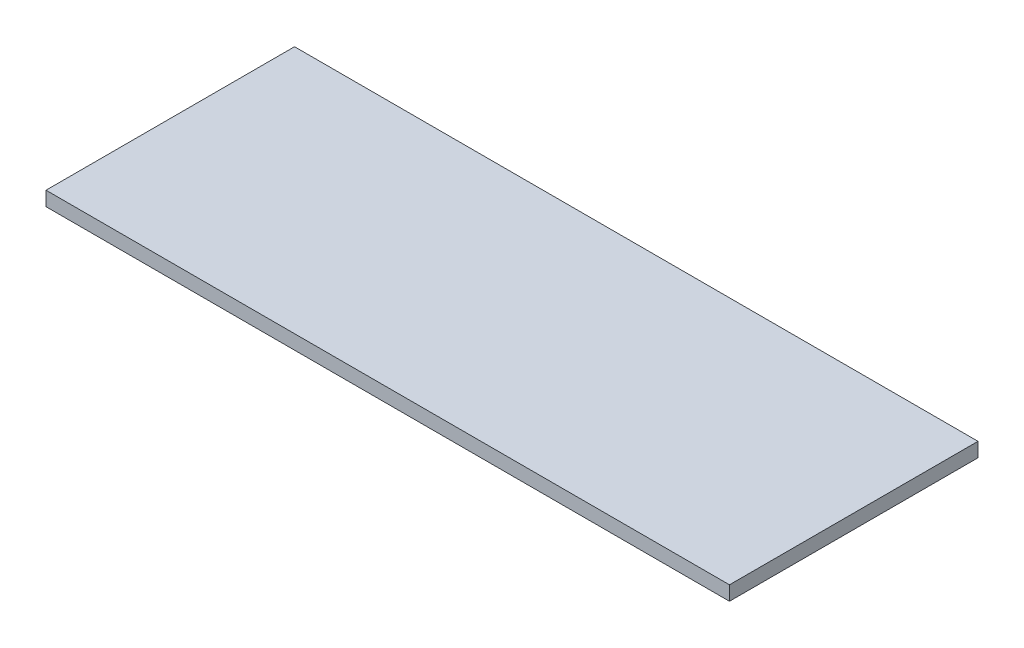
ISO-10303-21;
HEADER;
FILE_DESCRIPTION(('STEP AP214'),'2;1');
FILE_NAME('part.step','',(''),(''),'','','');
FILE_SCHEMA(('AUTOMOTIVE_DESIGN { 1 0 10303 214 1 1 1 1 }'));
ENDSEC;
DATA;
#1=APPLICATION_CONTEXT('core data for automotive mechanical design processes');
#2=APPLICATION_PROTOCOL_DEFINITION('international standard','automotive_design',2000,#1);
#3=PRODUCT_CONTEXT('',#1,'mechanical');
#4=PRODUCT('Part','Part','',(#3));
#5=PRODUCT_RELATED_PRODUCT_CATEGORY('part','',(#4));
#6=PRODUCT_DEFINITION_FORMATION('','',#4);
#7=PRODUCT_DEFINITION_CONTEXT('part definition',#1,'design');
#8=PRODUCT_DEFINITION('design','',#6,#7);
#9=PRODUCT_DEFINITION_SHAPE('','',#8);
#10=(LENGTH_UNIT() NAMED_UNIT(*) SI_UNIT(.MILLI.,.METRE.));
#11=(NAMED_UNIT(*) PLANE_ANGLE_UNIT() SI_UNIT($,.RADIAN.));
#12=(NAMED_UNIT(*) SI_UNIT($,.STERADIAN.) SOLID_ANGLE_UNIT());
#13=UNCERTAINTY_MEASURE_WITH_UNIT(LENGTH_MEASURE(1.E-05),#10,'distance_accuracy_value','');
#14=(GEOMETRIC_REPRESENTATION_CONTEXT(3) GLOBAL_UNCERTAINTY_ASSIGNED_CONTEXT((#13)) GLOBAL_UNIT_ASSIGNED_CONTEXT((#10,
#11,#12)) REPRESENTATION_CONTEXT('',''));
#15=CARTESIAN_POINT('',(0.,0.,0.));
#16=DIRECTION('',(0.,0.,1.));
#17=DIRECTION('',(1.,0.,0.));
#18=AXIS2_PLACEMENT_3D('',#15,#16,#17);
#19=CARTESIAN_POINT('',(0.,1.15,0.));
#20=DIRECTION('',(-1.,0.,0.));
#21=DIRECTION('',(0.,0.,1.));
#22=AXIS2_PLACEMENT_3D('',#19,#20,#21);
#23=PLANE('',#22);
#24=DIRECTION('',(0.,0.,-1.));
#25=VECTOR('',#24,1.);
#26=CARTESIAN_POINT('',(0.,0.,0.));
#27=LINE('',#26,#25);
#28=CARTESIAN_POINT('',(0.,0.,0.));
#29=VERTEX_POINT('',#28);
#30=CARTESIAN_POINT('',(0.,0.,-20.));
#31=VERTEX_POINT('',#30);
#32=EDGE_CURVE('E107',#29,#31,#27,.T.);
#33=ORIENTED_EDGE('',*,*,#32,.T.);
#34=DIRECTION('',(0.,-1.,0.));
#35=VECTOR('',#34,1.);
#36=CARTESIAN_POINT('',(0.,1.15,-20.));
#37=LINE('',#36,#35);
#38=CARTESIAN_POINT('',(0.,1.15,-20.));
#39=VERTEX_POINT('',#38);
#40=EDGE_CURVE('E11',#39,#31,#37,.T.);
#41=ORIENTED_EDGE('',*,*,#40,.F.);
#42=DIRECTION('',(0.,0.,-1.));
#43=VECTOR('',#42,1.);
#44=CARTESIAN_POINT('',(0.,1.15,0.));
#45=LINE('',#44,#43);
#46=CARTESIAN_POINT('',(0.,1.15,0.));
#47=VERTEX_POINT('',#46);
#48=EDGE_CURVE('E91',#47,#39,#45,.T.);
#49=ORIENTED_EDGE('',*,*,#48,.F.);
#50=DIRECTION('',(0.,-1.,0.));
#51=VECTOR('',#50,1.);
#52=CARTESIAN_POINT('',(0.,1.15,0.));
#53=LINE('',#52,#51);
#54=EDGE_CURVE('E103',#47,#29,#53,.T.);
#55=ORIENTED_EDGE('',*,*,#54,.T.);
#56=EDGE_LOOP('',(#33,#41,#49,#55));
#57=FACE_BOUND('',#56,.T.);
#58=ADVANCED_FACE('F39',(#57),#23,.F.);
#59=CARTESIAN_POINT('',(0.,1.15,-20.));
#60=DIRECTION('',(0.,0.,1.));
#61=DIRECTION('',(1.,0.,0.));
#62=AXIS2_PLACEMENT_3D('',#59,#60,#61);
#63=PLANE('',#62);
#64=DIRECTION('',(-1.,0.,0.));
#65=VECTOR('',#64,1.);
#66=CARTESIAN_POINT('',(0.,0.,-20.));
#67=LINE('',#66,#65);
#68=CARTESIAN_POINT('',(-55.,0.,-20.));
#69=VERTEX_POINT('',#68);
#70=EDGE_CURVE('E96',#31,#69,#67,.T.);
#71=ORIENTED_EDGE('',*,*,#70,.T.);
#72=DIRECTION('',(0.,-1.,0.));
#73=VECTOR('',#72,1.);
#74=CARTESIAN_POINT('',(-55.,1.15,-20.));
#75=LINE('',#74,#73);
#76=CARTESIAN_POINT('',(-55.,1.15,-20.));
#77=VERTEX_POINT('',#76);
#78=EDGE_CURVE('E48',#77,#69,#75,.T.);
#79=ORIENTED_EDGE('',*,*,#78,.F.);
#80=DIRECTION('',(-1.,0.,0.));
#81=VECTOR('',#80,1.);
#82=CARTESIAN_POINT('',(0.,1.15,-20.));
#83=LINE('',#82,#81);
#84=EDGE_CURVE('E86',#39,#77,#83,.T.);
#85=ORIENTED_EDGE('',*,*,#84,.F.);
#86=ORIENTED_EDGE('',*,*,#40,.T.);
#87=EDGE_LOOP('',(#71,#79,#85,#86));
#88=FACE_BOUND('',#87,.T.);
#89=ADVANCED_FACE('F95',(#88),#63,.F.);
#90=CARTESIAN_POINT('',(-55.,1.15,0.));
#91=DIRECTION('',(1.,0.,0.));
#92=DIRECTION('',(0.,0.,-1.));
#93=AXIS2_PLACEMENT_3D('',#90,#91,#92);
#94=PLANE('',#93);
#95=DIRECTION('',(0.,0.,1.));
#96=VECTOR('',#95,1.);
#97=CARTESIAN_POINT('',(-55.,0.,0.));
#98=LINE('',#97,#96);
#99=CARTESIAN_POINT('',(-55.,0.,0.));
#100=VERTEX_POINT('',#99);
#101=EDGE_CURVE('E73',#69,#100,#98,.T.);
#102=ORIENTED_EDGE('',*,*,#101,.T.);
#103=DIRECTION('',(0.,-1.,0.));
#104=VECTOR('',#103,1.);
#105=CARTESIAN_POINT('',(-55.,1.15,0.));
#106=LINE('',#105,#104);
#107=CARTESIAN_POINT('',(-55.,1.15,0.));
#108=VERTEX_POINT('',#107);
#109=EDGE_CURVE('E98',#108,#100,#106,.T.);
#110=ORIENTED_EDGE('',*,*,#109,.F.);
#111=DIRECTION('',(0.,0.,1.));
#112=VECTOR('',#111,1.);
#113=CARTESIAN_POINT('',(-55.,1.15,0.));
#114=LINE('',#113,#112);
#115=EDGE_CURVE('E89',#77,#108,#114,.T.);
#116=ORIENTED_EDGE('',*,*,#115,.F.);
#117=ORIENTED_EDGE('',*,*,#78,.T.);
#118=EDGE_LOOP('',(#102,#110,#116,#117));
#119=FACE_BOUND('',#118,.T.);
#120=ADVANCED_FACE('F99',(#119),#94,.F.);
#121=CARTESIAN_POINT('',(0.,1.15,0.));
#122=DIRECTION('',(0.,0.,-1.));
#123=DIRECTION('',(-1.,0.,0.));
#124=AXIS2_PLACEMENT_3D('',#121,#122,#123);
#125=PLANE('',#124);
#126=DIRECTION('',(1.,0.,0.));
#127=VECTOR('',#126,1.);
#128=CARTESIAN_POINT('',(0.,0.,0.));
#129=LINE('',#128,#127);
#130=EDGE_CURVE('E79',#100,#29,#129,.T.);
#131=ORIENTED_EDGE('',*,*,#130,.T.);
#132=ORIENTED_EDGE('',*,*,#54,.F.);
#133=DIRECTION('',(1.,0.,0.));
#134=VECTOR('',#133,1.);
#135=CARTESIAN_POINT('',(0.,1.15,0.));
#136=LINE('',#135,#134);
#137=EDGE_CURVE('E56',#108,#47,#136,.T.);
#138=ORIENTED_EDGE('',*,*,#137,.F.);
#139=ORIENTED_EDGE('',*,*,#109,.T.);
#140=EDGE_LOOP('',(#131,#132,#138,#139));
#141=FACE_BOUND('',#140,.T.);
#142=ADVANCED_FACE('F120',(#141),#125,.F.);
#143=CARTESIAN_POINT('',(0.,1.15,0.));
#144=DIRECTION('',(0.,1.,0.));
#145=DIRECTION('',(0.,0.,1.));
#146=AXIS2_PLACEMENT_3D('',#143,#144,#145);
#147=PLANE('',#146);
#148=ORIENTED_EDGE('',*,*,#48,.T.);
#149=ORIENTED_EDGE('',*,*,#84,.T.);
#150=ORIENTED_EDGE('',*,*,#115,.T.);
#151=ORIENTED_EDGE('',*,*,#137,.T.);
#152=EDGE_LOOP('',(#148,#149,#150,#151));
#153=FACE_BOUND('',#152,.T.);
#154=ADVANCED_FACE('F87',(#153),#147,.T.);
#155=CARTESIAN_POINT('',(0.,0.,0.));
#156=DIRECTION('',(0.,1.,0.));
#157=DIRECTION('',(0.,0.,1.));
#158=AXIS2_PLACEMENT_3D('',#155,#156,#157);
#159=PLANE('',#158);
#160=ORIENTED_EDGE('',*,*,#32,.F.);
#161=ORIENTED_EDGE('',*,*,#130,.F.);
#162=ORIENTED_EDGE('',*,*,#101,.F.);
#163=ORIENTED_EDGE('',*,*,#70,.F.);
#164=EDGE_LOOP('',(#160,#161,#162,#163));
#165=FACE_BOUND('',#164,.T.);
#166=ADVANCED_FACE('F123',(#165),#159,.F.);
#167=CLOSED_SHELL('',(#58,#89,#120,#142,#154,#166));
#168=MANIFOLD_SOLID_BREP('B2',#167);
#169=ADVANCED_BREP_SHAPE_REPRESENTATION('',(#18,#168),#14);
#170=SHAPE_DEFINITION_REPRESENTATION(#9,#169);
ENDSEC;
END-ISO-10303-21;
